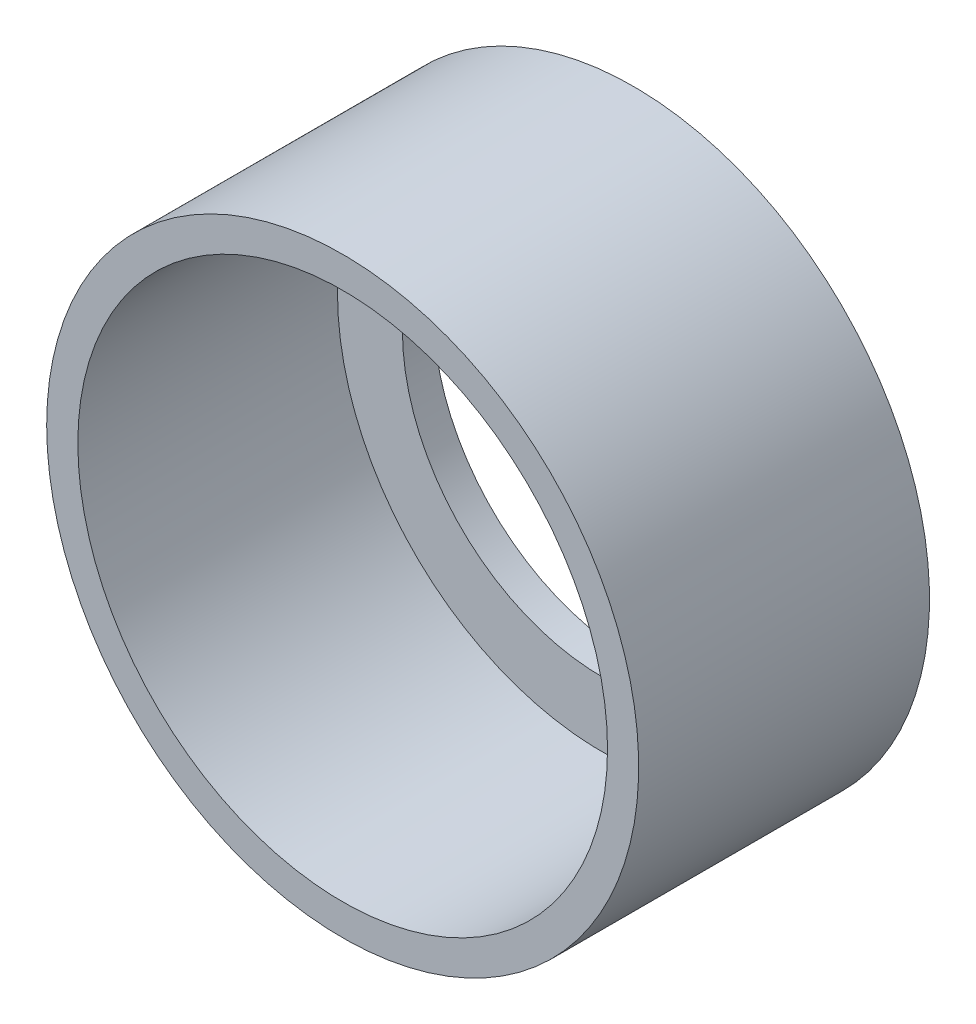
ISO-10303-21;
HEADER;
FILE_DESCRIPTION(('STEP AP214'),'2;1');
FILE_NAME('part.step','',(''),(''),'','','');
FILE_SCHEMA(('AUTOMOTIVE_DESIGN { 1 0 10303 214 1 1 1 1 }'));
ENDSEC;
DATA;
#1=APPLICATION_CONTEXT('core data for automotive mechanical design processes');
#2=APPLICATION_PROTOCOL_DEFINITION('international standard','automotive_design',2000,#1);
#3=PRODUCT_CONTEXT('',#1,'mechanical');
#4=PRODUCT('Part','Part','',(#3));
#5=PRODUCT_RELATED_PRODUCT_CATEGORY('part','',(#4));
#6=PRODUCT_DEFINITION_FORMATION('','',#4);
#7=PRODUCT_DEFINITION_CONTEXT('part definition',#1,'design');
#8=PRODUCT_DEFINITION('design','',#6,#7);
#9=PRODUCT_DEFINITION_SHAPE('','',#8);
#10=(LENGTH_UNIT() NAMED_UNIT(*) SI_UNIT(.MILLI.,.METRE.));
#11=(NAMED_UNIT(*) PLANE_ANGLE_UNIT() SI_UNIT($,.RADIAN.));
#12=(NAMED_UNIT(*) SI_UNIT($,.STERADIAN.) SOLID_ANGLE_UNIT());
#13=UNCERTAINTY_MEASURE_WITH_UNIT(LENGTH_MEASURE(1.E-05),#10,'distance_accuracy_value','');
#14=(GEOMETRIC_REPRESENTATION_CONTEXT(3) GLOBAL_UNCERTAINTY_ASSIGNED_CONTEXT((#13)) GLOBAL_UNIT_ASSIGNED_CONTEXT((#10,
#11,#12)) REPRESENTATION_CONTEXT('',''));
#15=CARTESIAN_POINT('',(0.,0.,0.));
#16=DIRECTION('',(0.,0.,1.));
#17=DIRECTION('',(1.,0.,0.));
#18=AXIS2_PLACEMENT_3D('',#15,#16,#17);
#19=CARTESIAN_POINT('',(0.,0.,-10.1790081681878));
#20=DIRECTION('',(0.,0.,-1.));
#21=DIRECTION('',(-1.,0.,0.));
#22=AXIS2_PLACEMENT_3D('',#19,#20,#21);
#23=CYLINDRICAL_SURFACE('',#22,12.954);
#24=CARTESIAN_POINT('',(0.,0.,-5.42563780231537));
#25=DIRECTION('',(0.,0.,-1.));
#26=DIRECTION('',(-1.,0.,0.));
#27=AXIS2_PLACEMENT_3D('',#24,#25,#26);
#28=CIRCLE('',#27,12.954);
#29=CARTESIAN_POINT('',(-12.954,0.,-5.42563780231537));
#30=VERTEX_POINT('',#29);
#31=EDGE_CURVE('E10',#30,#30,#28,.T.);
#32=ORIENTED_EDGE('',*,*,#31,.F.);
#33=EDGE_LOOP('',(#32));
#34=FACE_BOUND('',#33,.T.);
#35=CARTESIAN_POINT('',(0.,0.,-18.1256378023154));
#36=DIRECTION('',(0.,0.,-1.));
#37=DIRECTION('',(-1.,0.,0.));
#38=AXIS2_PLACEMENT_3D('',#35,#36,#37);
#39=CIRCLE('',#38,12.954);
#40=CARTESIAN_POINT('',(-12.954,0.,-18.1256378023154));
#41=VERTEX_POINT('',#40);
#42=EDGE_CURVE('E64',#41,#41,#39,.T.);
#43=ORIENTED_EDGE('',*,*,#42,.T.);
#44=EDGE_LOOP('',(#43));
#45=FACE_BOUND('',#44,.T.);
#46=ADVANCED_FACE('F37',(#34,#45),#23,.F.);
#47=CARTESIAN_POINT('',(12.954,0.,-5.42563780231537));
#48=DIRECTION('',(0.,0.,-1.));
#49=DIRECTION('',(-1.,0.,0.));
#50=AXIS2_PLACEMENT_3D('',#47,#48,#49);
#51=PLANE('',#50);
#52=CARTESIAN_POINT('',(0.,0.,-5.42563780231537));
#53=DIRECTION('',(0.,0.,-1.));
#54=DIRECTION('',(-1.,0.,0.));
#55=AXIS2_PLACEMENT_3D('',#52,#53,#54);
#56=CIRCLE('',#55,14.478);
#57=CARTESIAN_POINT('',(-14.478,0.,-5.42563780231537));
#58=VERTEX_POINT('',#57);
#59=EDGE_CURVE('E44',#58,#58,#56,.T.);
#60=ORIENTED_EDGE('',*,*,#59,.F.);
#61=EDGE_LOOP('',(#60));
#62=FACE_BOUND('',#61,.T.);
#63=ORIENTED_EDGE('',*,*,#31,.T.);
#64=EDGE_LOOP('',(#63));
#65=FACE_BOUND('',#64,.T.);
#66=ADVANCED_FACE('F90',(#62,#65),#51,.F.);
#67=CARTESIAN_POINT('',(0.,0.,-10.1790081681878));
#68=DIRECTION('',(0.,0.,-1.));
#69=DIRECTION('',(-1.,0.,0.));
#70=AXIS2_PLACEMENT_3D('',#67,#68,#69);
#71=CYLINDRICAL_SURFACE('',#70,14.478);
#72=CARTESIAN_POINT('',(0.,0.,-19.6496378023154));
#73=DIRECTION('',(0.,0.,-1.));
#74=DIRECTION('',(-1.,0.,0.));
#75=AXIS2_PLACEMENT_3D('',#72,#73,#74);
#76=CIRCLE('',#75,14.478);
#77=CARTESIAN_POINT('',(-14.478,0.,-19.6496378023154));
#78=VERTEX_POINT('',#77);
#79=EDGE_CURVE('E49',#78,#78,#76,.T.);
#80=ORIENTED_EDGE('',*,*,#79,.F.);
#81=EDGE_LOOP('',(#80));
#82=FACE_BOUND('',#81,.T.);
#83=ORIENTED_EDGE('',*,*,#59,.T.);
#84=EDGE_LOOP('',(#83));
#85=FACE_BOUND('',#84,.T.);
#86=ADVANCED_FACE('F85',(#82,#85),#71,.T.);
#87=CARTESIAN_POINT('',(14.478,0.,-19.6496378023154));
#88=DIRECTION('',(0.,0.,1.));
#89=DIRECTION('',(1.,0.,0.));
#90=AXIS2_PLACEMENT_3D('',#87,#88,#89);
#91=PLANE('',#90);
#92=CARTESIAN_POINT('',(0.,0.,-19.6496378023154));
#93=DIRECTION('',(0.,0.,-1.));
#94=DIRECTION('',(-1.,0.,0.));
#95=AXIS2_PLACEMENT_3D('',#92,#93,#94);
#96=CIRCLE('',#95,9.779);
#97=CARTESIAN_POINT('',(-9.779,0.,-19.6496378023154));
#98=VERTEX_POINT('',#97);
#99=EDGE_CURVE('E54',#98,#98,#96,.T.);
#100=ORIENTED_EDGE('',*,*,#99,.F.);
#101=EDGE_LOOP('',(#100));
#102=FACE_BOUND('',#101,.T.);
#103=ORIENTED_EDGE('',*,*,#79,.T.);
#104=EDGE_LOOP('',(#103));
#105=FACE_BOUND('',#104,.T.);
#106=ADVANCED_FACE('F79',(#102,#105),#91,.F.);
#107=CARTESIAN_POINT('',(0.,0.,-10.1790081681878));
#108=DIRECTION('',(0.,0.,-1.));
#109=DIRECTION('',(-1.,0.,0.));
#110=AXIS2_PLACEMENT_3D('',#107,#108,#109);
#111=CYLINDRICAL_SURFACE('',#110,9.779);
#112=CARTESIAN_POINT('',(0.,0.,-18.1256378023154));
#113=DIRECTION('',(0.,0.,-1.));
#114=DIRECTION('',(-1.,0.,0.));
#115=AXIS2_PLACEMENT_3D('',#112,#113,#114);
#116=CIRCLE('',#115,9.779);
#117=CARTESIAN_POINT('',(-9.779,0.,-18.1256378023154));
#118=VERTEX_POINT('',#117);
#119=EDGE_CURVE('E60',#118,#118,#116,.T.);
#120=ORIENTED_EDGE('',*,*,#119,.F.);
#121=EDGE_LOOP('',(#120));
#122=FACE_BOUND('',#121,.T.);
#123=ORIENTED_EDGE('',*,*,#99,.T.);
#124=EDGE_LOOP('',(#123));
#125=FACE_BOUND('',#124,.T.);
#126=ADVANCED_FACE('F73',(#122,#125),#111,.F.);
#127=CARTESIAN_POINT('',(9.779,0.,-18.1256378023154));
#128=DIRECTION('',(0.,0.,-1.));
#129=DIRECTION('',(-1.,0.,0.));
#130=AXIS2_PLACEMENT_3D('',#127,#128,#129);
#131=PLANE('',#130);
#132=ORIENTED_EDGE('',*,*,#42,.F.);
#133=EDGE_LOOP('',(#132));
#134=FACE_BOUND('',#133,.T.);
#135=ORIENTED_EDGE('',*,*,#119,.T.);
#136=EDGE_LOOP('',(#135));
#137=FACE_BOUND('',#136,.T.);
#138=ADVANCED_FACE('F70',(#134,#137),#131,.F.);
#139=CLOSED_SHELL('',(#46,#66,#86,#106,#126,#138));
#140=MANIFOLD_SOLID_BREP('B2',#139);
#141=ADVANCED_BREP_SHAPE_REPRESENTATION('',(#18,#140),#14);
#142=SHAPE_DEFINITION_REPRESENTATION(#9,#141);
ENDSEC;
END-ISO-10303-21;
